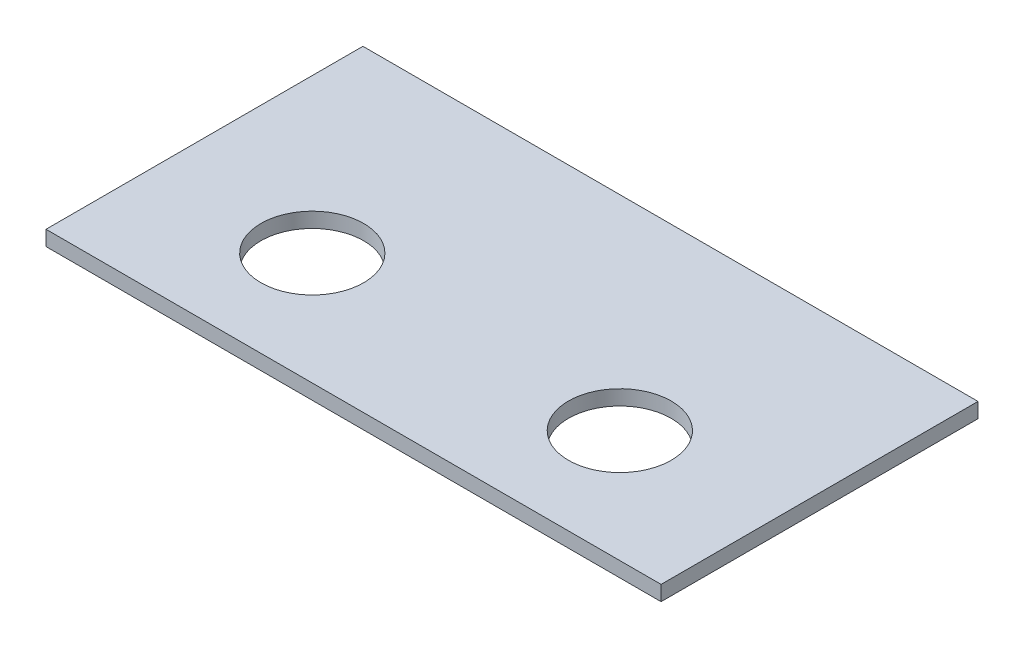
ISO-10303-21;
HEADER;
FILE_DESCRIPTION(('STEP AP214'),'2;1');
FILE_NAME('part.step','',(''),(''),'','','');
FILE_SCHEMA(('AUTOMOTIVE_DESIGN { 1 0 10303 214 1 1 1 1 }'));
ENDSEC;
DATA;
#1=APPLICATION_CONTEXT('core data for automotive mechanical design processes');
#2=APPLICATION_PROTOCOL_DEFINITION('international standard','automotive_design',2000,#1);
#3=PRODUCT_CONTEXT('',#1,'mechanical');
#4=PRODUCT('Part','Part','',(#3));
#5=PRODUCT_RELATED_PRODUCT_CATEGORY('part','',(#4));
#6=PRODUCT_DEFINITION_FORMATION('','',#4);
#7=PRODUCT_DEFINITION_CONTEXT('part definition',#1,'design');
#8=PRODUCT_DEFINITION('design','',#6,#7);
#9=PRODUCT_DEFINITION_SHAPE('','',#8);
#10=(LENGTH_UNIT() NAMED_UNIT(*) SI_UNIT(.MILLI.,.METRE.));
#11=(NAMED_UNIT(*) PLANE_ANGLE_UNIT() SI_UNIT($,.RADIAN.));
#12=(NAMED_UNIT(*) SI_UNIT($,.STERADIAN.) SOLID_ANGLE_UNIT());
#13=UNCERTAINTY_MEASURE_WITH_UNIT(LENGTH_MEASURE(1.E-05),#10,'distance_accuracy_value','');
#14=(GEOMETRIC_REPRESENTATION_CONTEXT(3) GLOBAL_UNCERTAINTY_ASSIGNED_CONTEXT((#13)) GLOBAL_UNIT_ASSIGNED_CONTEXT((#10,
#11,#12)) REPRESENTATION_CONTEXT('',''));
#15=CARTESIAN_POINT('',(0.,0.,0.));
#16=DIRECTION('',(0.,0.,1.));
#17=DIRECTION('',(1.,0.,0.));
#18=AXIS2_PLACEMENT_3D('',#15,#16,#17);
#19=CARTESIAN_POINT('',(0.,4.,0.));
#20=DIRECTION('',(0.,1.,0.));
#21=DIRECTION('',(0.,0.,1.));
#22=AXIS2_PLACEMENT_3D('',#19,#20,#21);
#23=PLANE('',#22);
#24=CARTESIAN_POINT('',(-41.,4.,12.25));
#25=DIRECTION('',(0.,1.,0.));
#26=DIRECTION('',(0.,0.,1.));
#27=AXIS2_PLACEMENT_3D('',#24,#25,#26);
#28=CIRCLE('',#27,13.7);
#29=CARTESIAN_POINT('',(-41.,4.,25.95));
#30=VERTEX_POINT('',#29);
#31=EDGE_CURVE('E104',#30,#30,#28,.T.);
#32=ORIENTED_EDGE('',*,*,#31,.F.);
#33=EDGE_LOOP('',(#32));
#34=FACE_BOUND('',#33,.T.);
#35=DIRECTION('',(0.,0.,-1.));
#36=VECTOR('',#35,1.);
#37=CARTESIAN_POINT('',(82.,4.,-42.25));
#38=LINE('',#37,#36);
#39=CARTESIAN_POINT('',(82.,4.,42.25));
#40=VERTEX_POINT('',#39);
#41=CARTESIAN_POINT('',(82.,4.,-42.25));
#42=VERTEX_POINT('',#41);
#43=EDGE_CURVE('E89',#40,#42,#38,.T.);
#44=ORIENTED_EDGE('',*,*,#43,.T.);
#45=DIRECTION('',(-1.,0.,0.));
#46=VECTOR('',#45,1.);
#47=CARTESIAN_POINT('',(-82.,4.,-42.25));
#48=LINE('',#47,#46);
#49=CARTESIAN_POINT('',(-82.,4.,-42.25));
#50=VERTEX_POINT('',#49);
#51=EDGE_CURVE('E84',#42,#50,#48,.T.);
#52=ORIENTED_EDGE('',*,*,#51,.T.);
#53=DIRECTION('',(0.,0.,1.));
#54=VECTOR('',#53,1.);
#55=CARTESIAN_POINT('',(-82.,4.,-42.25));
#56=LINE('',#55,#54);
#57=CARTESIAN_POINT('',(-82.,4.,42.25));
#58=VERTEX_POINT('',#57);
#59=EDGE_CURVE('E87',#50,#58,#56,.T.);
#60=ORIENTED_EDGE('',*,*,#59,.T.);
#61=DIRECTION('',(1.,0.,0.));
#62=VECTOR('',#61,1.);
#63=CARTESIAN_POINT('',(-82.,4.,42.25));
#64=LINE('',#63,#62);
#65=EDGE_CURVE('E54',#58,#40,#64,.T.);
#66=ORIENTED_EDGE('',*,*,#65,.T.);
#67=EDGE_LOOP('',(#44,#52,#60,#66));
#68=FACE_BOUND('',#67,.T.);
#69=CARTESIAN_POINT('',(41.,4.,12.25));
#70=DIRECTION('',(0.,1.,0.));
#71=DIRECTION('',(0.,0.,-1.));
#72=AXIS2_PLACEMENT_3D('',#69,#70,#71);
#73=CIRCLE('',#72,13.7);
#74=CARTESIAN_POINT('',(41.,4.,-1.45000000000002));
#75=VERTEX_POINT('',#74);
#76=EDGE_CURVE('E119',#75,#75,#73,.T.);
#77=ORIENTED_EDGE('',*,*,#76,.F.);
#78=EDGE_LOOP('',(#77));
#79=FACE_BOUND('',#78,.T.);
#80=ADVANCED_FACE('F37',(#34,#68,#79),#23,.T.);
#81=CARTESIAN_POINT('',(0.,0.,0.));
#82=DIRECTION('',(0.,1.,0.));
#83=DIRECTION('',(0.,0.,1.));
#84=AXIS2_PLACEMENT_3D('',#81,#82,#83);
#85=PLANE('',#84);
#86=DIRECTION('',(0.,0.,-1.));
#87=VECTOR('',#86,1.);
#88=CARTESIAN_POINT('',(82.,0.,-42.25));
#89=LINE('',#88,#87);
#90=CARTESIAN_POINT('',(82.,0.,42.25));
#91=VERTEX_POINT('',#90);
#92=CARTESIAN_POINT('',(82.,0.,-42.25));
#93=VERTEX_POINT('',#92);
#94=EDGE_CURVE('E101',#91,#93,#89,.T.);
#95=ORIENTED_EDGE('',*,*,#94,.F.);
#96=DIRECTION('',(1.,0.,0.));
#97=VECTOR('',#96,1.);
#98=CARTESIAN_POINT('',(-82.,0.,42.25));
#99=LINE('',#98,#97);
#100=CARTESIAN_POINT('',(-82.,0.,42.25));
#101=VERTEX_POINT('',#100);
#102=EDGE_CURVE('E77',#101,#91,#99,.T.);
#103=ORIENTED_EDGE('',*,*,#102,.F.);
#104=DIRECTION('',(0.,0.,1.));
#105=VECTOR('',#104,1.);
#106=CARTESIAN_POINT('',(-82.,0.,-42.25));
#107=LINE('',#106,#105);
#108=CARTESIAN_POINT('',(-82.,0.,-42.25));
#109=VERTEX_POINT('',#108);
#110=EDGE_CURVE('E71',#109,#101,#107,.T.);
#111=ORIENTED_EDGE('',*,*,#110,.F.);
#112=DIRECTION('',(-1.,0.,0.));
#113=VECTOR('',#112,1.);
#114=CARTESIAN_POINT('',(-82.,0.,-42.25));
#115=LINE('',#114,#113);
#116=EDGE_CURVE('E93',#93,#109,#115,.T.);
#117=ORIENTED_EDGE('',*,*,#116,.F.);
#118=EDGE_LOOP('',(#95,#103,#111,#117));
#119=FACE_BOUND('',#118,.T.);
#120=CARTESIAN_POINT('',(-41.,0.,12.25));
#121=DIRECTION('',(0.,1.,0.));
#122=DIRECTION('',(0.,0.,1.));
#123=AXIS2_PLACEMENT_3D('',#120,#121,#122);
#124=CIRCLE('',#123,13.7);
#125=CARTESIAN_POINT('',(-41.,0.,25.95));
#126=VERTEX_POINT('',#125);
#127=EDGE_CURVE('E116',#126,#126,#124,.T.);
#128=ORIENTED_EDGE('',*,*,#127,.T.);
#129=EDGE_LOOP('',(#128));
#130=FACE_BOUND('',#129,.T.);
#131=CARTESIAN_POINT('',(41.,0.,12.25));
#132=DIRECTION('',(0.,1.,0.));
#133=DIRECTION('',(0.,0.,-1.));
#134=AXIS2_PLACEMENT_3D('',#131,#132,#133);
#135=CIRCLE('',#134,13.7);
#136=CARTESIAN_POINT('',(41.,0.,-1.45000000000002));
#137=VERTEX_POINT('',#136);
#138=EDGE_CURVE('E122',#137,#137,#135,.T.);
#139=ORIENTED_EDGE('',*,*,#138,.T.);
#140=EDGE_LOOP('',(#139));
#141=FACE_BOUND('',#140,.T.);
#142=ADVANCED_FACE('F112',(#119,#130,#141),#85,.F.);
#143=CARTESIAN_POINT('',(82.,4.,-42.25));
#144=DIRECTION('',(-1.,0.,0.));
#145=DIRECTION('',(0.,0.,1.));
#146=AXIS2_PLACEMENT_3D('',#143,#144,#145);
#147=PLANE('',#146);
#148=ORIENTED_EDGE('',*,*,#94,.T.);
#149=DIRECTION('',(0.,-1.,0.));
#150=VECTOR('',#149,1.);
#151=CARTESIAN_POINT('',(82.,4.,-42.25));
#152=LINE('',#151,#150);
#153=EDGE_CURVE('E11',#42,#93,#152,.T.);
#154=ORIENTED_EDGE('',*,*,#153,.F.);
#155=ORIENTED_EDGE('',*,*,#43,.F.);
#156=DIRECTION('',(0.,-1.,0.));
#157=VECTOR('',#156,1.);
#158=CARTESIAN_POINT('',(82.,4.,42.25));
#159=LINE('',#158,#157);
#160=EDGE_CURVE('E97',#40,#91,#159,.T.);
#161=ORIENTED_EDGE('',*,*,#160,.T.);
#162=EDGE_LOOP('',(#148,#154,#155,#161));
#163=FACE_BOUND('',#162,.T.);
#164=ADVANCED_FACE('F39',(#163),#147,.F.);
#165=CARTESIAN_POINT('',(-82.,4.,-42.25));
#166=DIRECTION('',(0.,0.,1.));
#167=DIRECTION('',(1.,0.,0.));
#168=AXIS2_PLACEMENT_3D('',#165,#166,#167);
#169=PLANE('',#168);
#170=ORIENTED_EDGE('',*,*,#116,.T.);
#171=DIRECTION('',(0.,-1.,0.));
#172=VECTOR('',#171,1.);
#173=CARTESIAN_POINT('',(-82.,4.,-42.25));
#174=LINE('',#173,#172);
#175=EDGE_CURVE('E46',#50,#109,#174,.T.);
#176=ORIENTED_EDGE('',*,*,#175,.F.);
#177=ORIENTED_EDGE('',*,*,#51,.F.);
#178=ORIENTED_EDGE('',*,*,#153,.T.);
#179=EDGE_LOOP('',(#170,#176,#177,#178));
#180=FACE_BOUND('',#179,.T.);
#181=ADVANCED_FACE('F92',(#180),#169,.F.);
#182=CARTESIAN_POINT('',(-82.,4.,-42.25));
#183=DIRECTION('',(1.,0.,0.));
#184=DIRECTION('',(0.,0.,-1.));
#185=AXIS2_PLACEMENT_3D('',#182,#183,#184);
#186=PLANE('',#185);
#187=ORIENTED_EDGE('',*,*,#110,.T.);
#188=DIRECTION('',(0.,-1.,0.));
#189=VECTOR('',#188,1.);
#190=CARTESIAN_POINT('',(-82.,4.,42.25));
#191=LINE('',#190,#189);
#192=EDGE_CURVE('E94',#58,#101,#191,.T.);
#193=ORIENTED_EDGE('',*,*,#192,.F.);
#194=ORIENTED_EDGE('',*,*,#59,.F.);
#195=ORIENTED_EDGE('',*,*,#175,.T.);
#196=EDGE_LOOP('',(#187,#193,#194,#195));
#197=FACE_BOUND('',#196,.T.);
#198=ADVANCED_FACE('F95',(#197),#186,.F.);
#199=CARTESIAN_POINT('',(-82.,4.,42.25));
#200=DIRECTION('',(0.,0.,-1.));
#201=DIRECTION('',(-1.,0.,0.));
#202=AXIS2_PLACEMENT_3D('',#199,#200,#201);
#203=PLANE('',#202);
#204=ORIENTED_EDGE('',*,*,#102,.T.);
#205=ORIENTED_EDGE('',*,*,#160,.F.);
#206=ORIENTED_EDGE('',*,*,#65,.F.);
#207=ORIENTED_EDGE('',*,*,#192,.T.);
#208=EDGE_LOOP('',(#204,#205,#206,#207));
#209=FACE_BOUND('',#208,.T.);
#210=ADVANCED_FACE('F109',(#209),#203,.F.);
#211=CARTESIAN_POINT('',(-41.,4.,12.25));
#212=DIRECTION('',(0.,-1.,0.));
#213=DIRECTION('',(0.,0.,-1.));
#214=AXIS2_PLACEMENT_3D('',#211,#212,#213);
#215=CYLINDRICAL_SURFACE('',#214,13.7);
#216=ORIENTED_EDGE('',*,*,#31,.T.);
#217=EDGE_LOOP('',(#216));
#218=FACE_BOUND('',#217,.T.);
#219=ORIENTED_EDGE('',*,*,#127,.F.);
#220=EDGE_LOOP('',(#219));
#221=FACE_BOUND('',#220,.T.);
#222=ADVANCED_FACE('F139',(#218,#221),#215,.F.);
#223=CARTESIAN_POINT('',(41.,4.,12.25));
#224=DIRECTION('',(0.,-1.,0.));
#225=DIRECTION('',(0.,0.,-1.));
#226=AXIS2_PLACEMENT_3D('',#223,#224,#225);
#227=CYLINDRICAL_SURFACE('',#226,13.7);
#228=ORIENTED_EDGE('',*,*,#76,.T.);
#229=EDGE_LOOP('',(#228));
#230=FACE_BOUND('',#229,.T.);
#231=ORIENTED_EDGE('',*,*,#138,.F.);
#232=EDGE_LOOP('',(#231));
#233=FACE_BOUND('',#232,.T.);
#234=ADVANCED_FACE('F128',(#230,#233),#227,.F.);
#235=CLOSED_SHELL('',(#80,#142,#164,#181,#198,#210,#222,#234));
#236=MANIFOLD_SOLID_BREP('B2',#235);
#237=ADVANCED_BREP_SHAPE_REPRESENTATION('',(#18,#236),#14);
#238=SHAPE_DEFINITION_REPRESENTATION(#9,#237);
ENDSEC;
END-ISO-10303-21;
